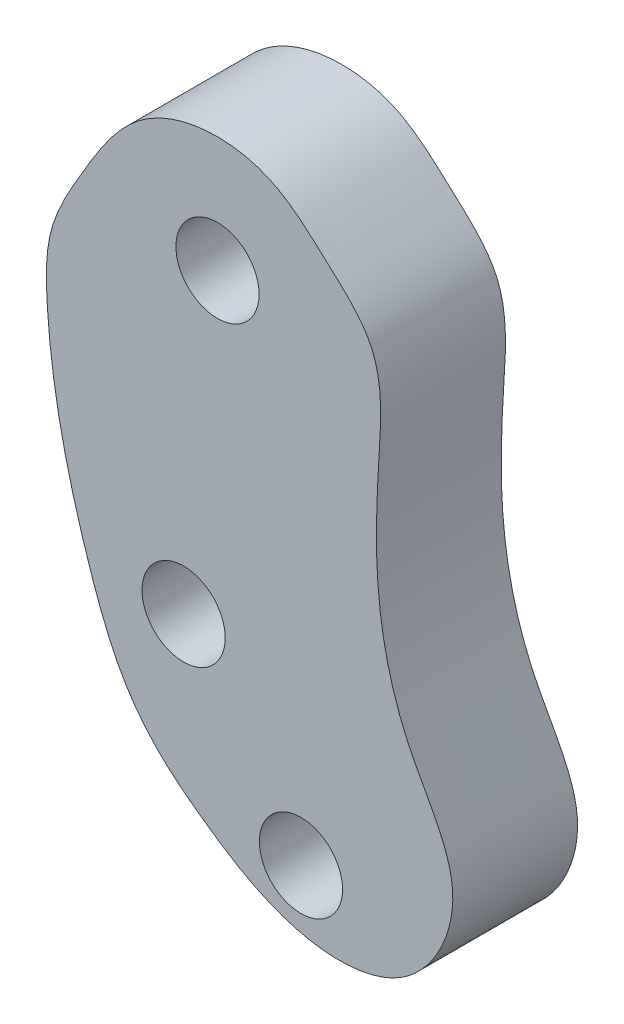
ISO-10303-21;
HEADER;
FILE_DESCRIPTION(('STEP AP214'),'2;1');
FILE_NAME('part.step','',(''),(''),'','','');
FILE_SCHEMA(('AUTOMOTIVE_DESIGN { 1 0 10303 214 1 1 1 1 }'));
ENDSEC;
DATA;
#1=APPLICATION_CONTEXT('core data for automotive mechanical design processes');
#2=APPLICATION_PROTOCOL_DEFINITION('international standard','automotive_design',2000,#1);
#3=PRODUCT_CONTEXT('',#1,'mechanical');
#4=PRODUCT('Part','Part','',(#3));
#5=PRODUCT_RELATED_PRODUCT_CATEGORY('part','',(#4));
#6=PRODUCT_DEFINITION_FORMATION('','',#4);
#7=PRODUCT_DEFINITION_CONTEXT('part definition',#1,'design');
#8=PRODUCT_DEFINITION('design','',#6,#7);
#9=PRODUCT_DEFINITION_SHAPE('','',#8);
#10=(LENGTH_UNIT() NAMED_UNIT(*) SI_UNIT(.MILLI.,.METRE.));
#11=(NAMED_UNIT(*) PLANE_ANGLE_UNIT() SI_UNIT($,.RADIAN.));
#12=(NAMED_UNIT(*) SI_UNIT($,.STERADIAN.) SOLID_ANGLE_UNIT());
#13=UNCERTAINTY_MEASURE_WITH_UNIT(LENGTH_MEASURE(1.E-05),#10,'distance_accuracy_value','');
#14=(GEOMETRIC_REPRESENTATION_CONTEXT(3) GLOBAL_UNCERTAINTY_ASSIGNED_CONTEXT((#13)) GLOBAL_UNIT_ASSIGNED_CONTEXT((#10,
#11,#12)) REPRESENTATION_CONTEXT('',''));
#15=CARTESIAN_POINT('',(0.,0.,0.));
#16=DIRECTION('',(0.,0.,1.));
#17=DIRECTION('',(1.,0.,0.));
#18=AXIS2_PLACEMENT_3D('',#15,#16,#17);
#19=CARTESIAN_POINT('',(-6.43363630113266,19.2135696791131,3.));
#20=DIRECTION('',(0.,0.,1.));
#21=DIRECTION('',(1.,0.,0.));
#22=AXIS2_PLACEMENT_3D('',#19,#20,#21);
#23=PLANE('',#22);
#24=CARTESIAN_POINT('',(-8.58720341936765,20.4790701814029,3.));
#25=DIRECTION('',(0.,0.,1.));
#26=DIRECTION('',(1.,0.,0.));
#27=AXIS2_PLACEMENT_3D('',#24,#25,#26);
#28=CIRCLE('',#27,1.);
#29=CARTESIAN_POINT('',(-7.58720341936765,20.4790701814029,3.));
#30=VERTEX_POINT('',#29);
#31=EDGE_CURVE('E57',#30,#30,#28,.T.);
#32=ORIENTED_EDGE('',*,*,#31,.F.);
#33=EDGE_LOOP('',(#32));
#34=FACE_BOUND('',#33,.T.);
#35=CARTESIAN_POINT('',(-12.4811256398003,34.0371097195467,3.));
#36=CARTESIAN_POINT('',(-13.0608042347016,33.5931046889083,3.));
#37=CARTESIAN_POINT('',(-13.7826226788482,32.386488529031,3.));
#38=CARTESIAN_POINT('',(-14.7358598319157,30.7556767711777,3.));
#39=CARTESIAN_POINT('',(-14.704000852025,28.7160620439829,3.));
#40=CARTESIAN_POINT('',(-14.3894849885536,26.5454142527358,3.));
#41=CARTESIAN_POINT('',(-13.7012589196228,24.1421106681356,3.));
#42=CARTESIAN_POINT('',(-12.977887527559,22.2499551445667,3.));
#43=CARTESIAN_POINT('',(-11.9646421663812,21.035426327989,3.));
#44=CARTESIAN_POINT('',(-10.5622760929559,19.9424529970378,3.));
#45=CARTESIAN_POINT('',(-8.67140559116609,18.7909084618657,3.));
#46=CARTESIAN_POINT('',(-5.78494789748129,19.0556755918441,3.));
#47=CARTESIAN_POINT('',(-4.41459560662867,21.8576045155782,3.));
#48=CARTESIAN_POINT('',(-6.22264184108919,24.2635318865217,3.));
#49=CARTESIAN_POINT('',(-6.85611352114202,27.1075918609962,3.));
#50=CARTESIAN_POINT('',(-6.7328228058773,29.7293254398268,3.));
#51=CARTESIAN_POINT('',(-6.56574965997691,32.1076836052141,3.));
#52=CARTESIAN_POINT('',(-8.01266662993203,33.3834446081081,3.));
#53=CARTESIAN_POINT('',(-9.45078762323375,34.7411565459288,3.));
#54=CARTESIAN_POINT('',(-11.3666850176257,34.7307790270972,3.));
#55=CARTESIAN_POINT('',(-12.3020857281586,34.1742454049993,3.));
#56=CARTESIAN_POINT('',(-12.4811256398003,34.0371097195467,3.));
#57=B_SPLINE_CURVE_WITH_KNOTS('',3,(#35,#36,#37,#38,#39,#40,#41,#42,#43,#44,#45,#46,#47,#48,#49,
#50,#51,#52,#53,#54,#55,#56),.UNSPECIFIED.,.T.,.F.,(4,1,1,1,1,1,1,1,1,1,1,1,1,1,1,1,1,1,1,4),
(0.,0.0545407182761287,0.100916149937136,0.137032322676604,0.201958421693638,0.26381745066,
0.322052407060467,0.34987526810075,0.379619499796883,0.45381323742695,0.508716038363188,
0.573528831572358,0.639011845197967,0.715796749125624,0.785027059634507,0.837720982300538,
0.878324797205377,0.920064020379721,0.98315451792265,1.),.UNSPECIFIED.);
#58=CARTESIAN_POINT('',(-12.4811256398003,34.0371097195467,3.));
#59=VERTEX_POINT('',#58);
#60=EDGE_CURVE('E10',#59,#59,#57,.T.);
#61=ORIENTED_EDGE('',*,*,#60,.T.);
#62=EDGE_LOOP('',(#61));
#63=FACE_BOUND('',#62,.T.);
#64=CARTESIAN_POINT('',(-10.5938469292639,31.8637890474289,3.));
#65=DIRECTION('',(0.,0.,1.));
#66=DIRECTION('',(1.,0.,0.));
#67=AXIS2_PLACEMENT_3D('',#64,#65,#66);
#68=CIRCLE('',#67,1.);
#69=CARTESIAN_POINT('',(-9.5938469292639,31.8637890474289,3.));
#70=VERTEX_POINT('',#69);
#71=EDGE_CURVE('E46',#70,#70,#68,.T.);
#72=ORIENTED_EDGE('',*,*,#71,.F.);
#73=EDGE_LOOP('',(#72));
#74=FACE_BOUND('',#73,.T.);
#75=CARTESIAN_POINT('',(-11.4085823915518,24.3035135707676,3.));
#76=DIRECTION('',(0.,0.,1.));
#77=DIRECTION('',(1.,0.,0.));
#78=AXIS2_PLACEMENT_3D('',#75,#76,#77);
#79=CIRCLE('',#78,1.);
#80=CARTESIAN_POINT('',(-10.4085823915517,24.3035135707676,3.));
#81=VERTEX_POINT('',#80);
#82=EDGE_CURVE('E63',#81,#81,#79,.T.);
#83=ORIENTED_EDGE('',*,*,#82,.F.);
#84=EDGE_LOOP('',(#83));
#85=FACE_BOUND('',#84,.T.);
#86=ADVANCED_FACE('F33',(#34,#63,#74,#85),#23,.T.);
#87=CARTESIAN_POINT('',(-6.43363630113266,19.2135696791131,0.));
#88=DIRECTION('',(0.,0.,1.));
#89=DIRECTION('',(1.,0.,0.));
#90=AXIS2_PLACEMENT_3D('',#87,#88,#89);
#91=PLANE('',#90);
#92=CARTESIAN_POINT('',(-12.4811256398003,34.0371097195467,0.));
#93=CARTESIAN_POINT('',(-13.0608042347016,33.5931046889083,0.));
#94=CARTESIAN_POINT('',(-13.7826226788482,32.386488529031,0.));
#95=CARTESIAN_POINT('',(-14.7358598319157,30.7556767711777,0.));
#96=CARTESIAN_POINT('',(-14.704000852025,28.7160620439829,0.));
#97=CARTESIAN_POINT('',(-14.3894849885536,26.5454142527358,0.));
#98=CARTESIAN_POINT('',(-13.7012589196228,24.1421106681356,0.));
#99=CARTESIAN_POINT('',(-12.977887527559,22.2499551445667,0.));
#100=CARTESIAN_POINT('',(-11.9646421663812,21.035426327989,0.));
#101=CARTESIAN_POINT('',(-10.5622760929559,19.9424529970378,0.));
#102=CARTESIAN_POINT('',(-8.67140559116609,18.7909084618657,0.));
#103=CARTESIAN_POINT('',(-5.78494789748129,19.0556755918441,0.));
#104=CARTESIAN_POINT('',(-4.41459560662867,21.8576045155782,0.));
#105=CARTESIAN_POINT('',(-6.22264184108919,24.2635318865217,0.));
#106=CARTESIAN_POINT('',(-6.85611352114202,27.1075918609962,0.));
#107=CARTESIAN_POINT('',(-6.7328228058773,29.7293254398268,0.));
#108=CARTESIAN_POINT('',(-6.56574965997691,32.1076836052141,0.));
#109=CARTESIAN_POINT('',(-8.01266662993203,33.3834446081081,0.));
#110=CARTESIAN_POINT('',(-9.45078762323375,34.7411565459288,0.));
#111=CARTESIAN_POINT('',(-11.3666850176257,34.7307790270972,0.));
#112=CARTESIAN_POINT('',(-12.3020857281586,34.1742454049993,0.));
#113=CARTESIAN_POINT('',(-12.4811256398003,34.0371097195467,0.));
#114=B_SPLINE_CURVE_WITH_KNOTS('',3,(#92,#93,#94,#95,#96,#97,#98,#99,#100,#101,#102,#103,#104,
#105,#106,#107,#108,#109,#110,#111,#112,#113),.UNSPECIFIED.,.T.,.F.,(4,1,1,1,1,1,1,1,1,1,1,1,1,
1,1,1,1,1,1,4),(0.,0.0545407182761287,0.100916149937136,0.137032322676604,0.201958421693638,
0.26381745066,0.322052407060467,0.34987526810075,0.379619499796883,0.45381323742695,
0.508716038363188,0.573528831572358,0.639011845197967,0.715796749125624,0.785027059634507,
0.837720982300538,0.878324797205377,0.920064020379721,0.98315451792265,1.),.UNSPECIFIED.);
#115=CARTESIAN_POINT('',(-12.4811256398003,34.0371097195467,0.));
#116=VERTEX_POINT('',#115);
#117=EDGE_CURVE('E38',#116,#116,#114,.T.);
#118=ORIENTED_EDGE('',*,*,#117,.F.);
#119=EDGE_LOOP('',(#118));
#120=FACE_BOUND('',#119,.T.);
#121=CARTESIAN_POINT('',(-10.5938469292639,31.8637890474289,0.));
#122=DIRECTION('',(0.,0.,1.));
#123=DIRECTION('',(1.,0.,0.));
#124=AXIS2_PLACEMENT_3D('',#121,#122,#123);
#125=CIRCLE('',#124,1.);
#126=CARTESIAN_POINT('',(-9.5938469292639,31.8637890474289,0.));
#127=VERTEX_POINT('',#126);
#128=EDGE_CURVE('E51',#127,#127,#125,.T.);
#129=ORIENTED_EDGE('',*,*,#128,.T.);
#130=EDGE_LOOP('',(#129));
#131=FACE_BOUND('',#130,.T.);
#132=CARTESIAN_POINT('',(-8.58720341936765,20.4790701814029,0.));
#133=DIRECTION('',(0.,0.,1.));
#134=DIRECTION('',(1.,0.,0.));
#135=AXIS2_PLACEMENT_3D('',#132,#133,#134);
#136=CIRCLE('',#135,1.);
#137=CARTESIAN_POINT('',(-7.58720341936765,20.4790701814029,0.));
#138=VERTEX_POINT('',#137);
#139=EDGE_CURVE('E60',#138,#138,#136,.T.);
#140=ORIENTED_EDGE('',*,*,#139,.T.);
#141=EDGE_LOOP('',(#140));
#142=FACE_BOUND('',#141,.T.);
#143=CARTESIAN_POINT('',(-11.4085823915518,24.3035135707676,0.));
#144=DIRECTION('',(0.,0.,1.));
#145=DIRECTION('',(1.,0.,0.));
#146=AXIS2_PLACEMENT_3D('',#143,#144,#145);
#147=CIRCLE('',#146,1.);
#148=CARTESIAN_POINT('',(-10.4085823915517,24.3035135707676,0.));
#149=VERTEX_POINT('',#148);
#150=EDGE_CURVE('E66',#149,#149,#147,.T.);
#151=ORIENTED_EDGE('',*,*,#150,.T.);
#152=EDGE_LOOP('',(#151));
#153=FACE_BOUND('',#152,.T.);
#154=ADVANCED_FACE('F76',(#120,#131,#142,#153),#91,.F.);
#155=DIRECTION('',(0.,0.,-1.));
#156=VECTOR('',#155,1.);
#157=SURFACE_OF_LINEAR_EXTRUSION('',#57,#156);
#158=ORIENTED_EDGE('',*,*,#60,.F.);
#159=EDGE_LOOP('',(#158));
#160=FACE_BOUND('',#159,.T.);
#161=ORIENTED_EDGE('',*,*,#117,.T.);
#162=EDGE_LOOP('',(#161));
#163=FACE_BOUND('',#162,.T.);
#164=ADVANCED_FACE('F35',(#160,#163),#157,.F.);
#165=CARTESIAN_POINT('',(-10.5938469292639,31.8637890474289,3.));
#166=DIRECTION('',(0.,0.,-1.));
#167=DIRECTION('',(-1.,0.,0.));
#168=AXIS2_PLACEMENT_3D('',#165,#166,#167);
#169=CYLINDRICAL_SURFACE('',#168,1.);
#170=ORIENTED_EDGE('',*,*,#71,.T.);
#171=EDGE_LOOP('',(#170));
#172=FACE_BOUND('',#171,.T.);
#173=ORIENTED_EDGE('',*,*,#128,.F.);
#174=EDGE_LOOP('',(#173));
#175=FACE_BOUND('',#174,.T.);
#176=ADVANCED_FACE('F85',(#172,#175),#169,.F.);
#177=CARTESIAN_POINT('',(-8.58720341936765,20.4790701814029,3.));
#178=DIRECTION('',(0.,0.,-1.));
#179=DIRECTION('',(-1.,0.,0.));
#180=AXIS2_PLACEMENT_3D('',#177,#178,#179);
#181=CYLINDRICAL_SURFACE('',#180,1.);
#182=ORIENTED_EDGE('',*,*,#31,.T.);
#183=EDGE_LOOP('',(#182));
#184=FACE_BOUND('',#183,.T.);
#185=ORIENTED_EDGE('',*,*,#139,.F.);
#186=EDGE_LOOP('',(#185));
#187=FACE_BOUND('',#186,.T.);
#188=ADVANCED_FACE('F88',(#184,#187),#181,.F.);
#189=CARTESIAN_POINT('',(-11.4085823915518,24.3035135707676,3.));
#190=DIRECTION('',(0.,0.,-1.));
#191=DIRECTION('',(-1.,0.,0.));
#192=AXIS2_PLACEMENT_3D('',#189,#190,#191);
#193=CYLINDRICAL_SURFACE('',#192,1.);
#194=ORIENTED_EDGE('',*,*,#82,.T.);
#195=EDGE_LOOP('',(#194));
#196=FACE_BOUND('',#195,.T.);
#197=ORIENTED_EDGE('',*,*,#150,.F.);
#198=EDGE_LOOP('',(#197));
#199=FACE_BOUND('',#198,.T.);
#200=ADVANCED_FACE('F72',(#196,#199),#193,.F.);
#201=CLOSED_SHELL('',(#86,#154,#164,#176,#188,#200));
#202=MANIFOLD_SOLID_BREP('B2',#201);
#203=ADVANCED_BREP_SHAPE_REPRESENTATION('',(#18,#202),#14);
#204=SHAPE_DEFINITION_REPRESENTATION(#9,#203);
ENDSEC;
END-ISO-10303-21;
